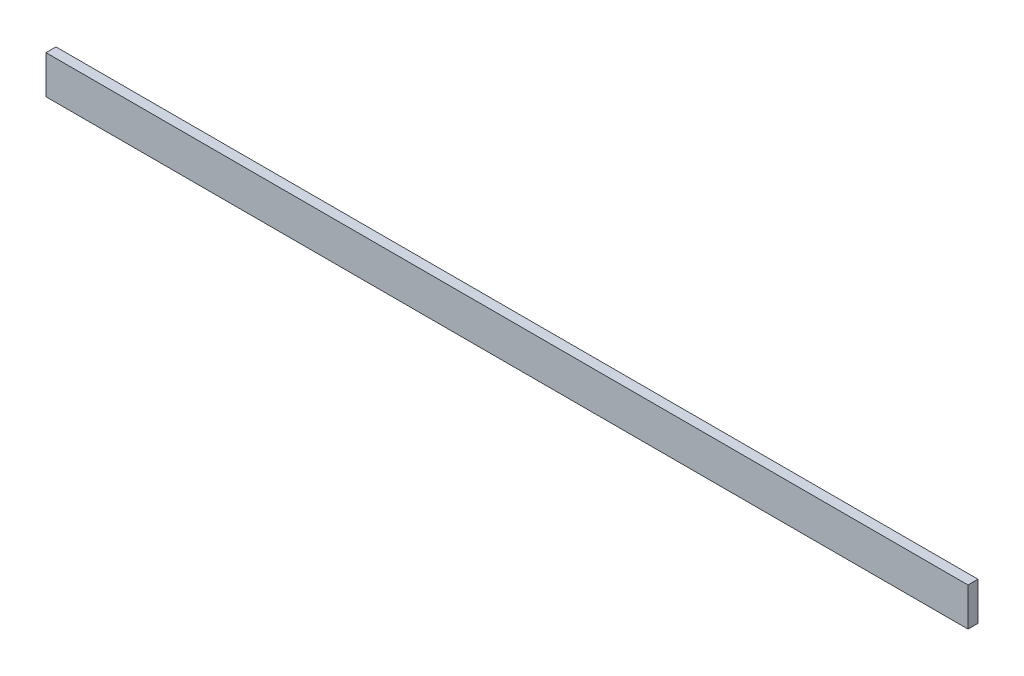
ISO-10303-21;
HEADER;
FILE_DESCRIPTION(('STEP AP214'),'2;1');
FILE_NAME('part.step','',(''),(''),'','','');
FILE_SCHEMA(('AUTOMOTIVE_DESIGN { 1 0 10303 214 1 1 1 1 }'));
ENDSEC;
DATA;
#1=APPLICATION_CONTEXT('core data for automotive mechanical design processes');
#2=APPLICATION_PROTOCOL_DEFINITION('international standard','automotive_design',2000,#1);
#3=PRODUCT_CONTEXT('',#1,'mechanical');
#4=PRODUCT('Part','Part','',(#3));
#5=PRODUCT_RELATED_PRODUCT_CATEGORY('part','',(#4));
#6=PRODUCT_DEFINITION_FORMATION('','',#4);
#7=PRODUCT_DEFINITION_CONTEXT('part definition',#1,'design');
#8=PRODUCT_DEFINITION('design','',#6,#7);
#9=PRODUCT_DEFINITION_SHAPE('','',#8);
#10=(LENGTH_UNIT() NAMED_UNIT(*) SI_UNIT(.MILLI.,.METRE.));
#11=(NAMED_UNIT(*) PLANE_ANGLE_UNIT() SI_UNIT($,.RADIAN.));
#12=(NAMED_UNIT(*) SI_UNIT($,.STERADIAN.) SOLID_ANGLE_UNIT());
#13=UNCERTAINTY_MEASURE_WITH_UNIT(LENGTH_MEASURE(1.E-05),#10,'distance_accuracy_value','');
#14=(GEOMETRIC_REPRESENTATION_CONTEXT(3) GLOBAL_UNCERTAINTY_ASSIGNED_CONTEXT((#13)) GLOBAL_UNIT_ASSIGNED_CONTEXT((#10,
#11,#12)) REPRESENTATION_CONTEXT('',''));
#15=CARTESIAN_POINT('',(0.,0.,0.));
#16=DIRECTION('',(0.,0.,1.));
#17=DIRECTION('',(1.,0.,0.));
#18=AXIS2_PLACEMENT_3D('',#15,#16,#17);
#19=CARTESIAN_POINT('',(0.,38.2926221353073,10.));
#20=DIRECTION('',(1.,0.,0.));
#21=DIRECTION('',(0.,0.,-1.));
#22=AXIS2_PLACEMENT_3D('',#19,#20,#21);
#23=PLANE('',#22);
#24=DIRECTION('',(0.,-1.,0.));
#25=VECTOR('',#24,1.);
#26=CARTESIAN_POINT('',(0.,38.2926221353073,0.));
#27=LINE('',#26,#25);
#28=CARTESIAN_POINT('',(0.,38.2926221353073,0.));
#29=VERTEX_POINT('',#28);
#30=CARTESIAN_POINT('',(0.,0.,0.));
#31=VERTEX_POINT('',#30);
#32=EDGE_CURVE('E113',#29,#31,#27,.T.);
#33=ORIENTED_EDGE('',*,*,#32,.T.);
#34=DIRECTION('',(0.,0.,-1.));
#35=VECTOR('',#34,1.);
#36=CARTESIAN_POINT('',(0.,0.,10.));
#37=LINE('',#36,#35);
#38=CARTESIAN_POINT('',(0.,0.,10.));
#39=VERTEX_POINT('',#38);
#40=EDGE_CURVE('E11',#39,#31,#37,.T.);
#41=ORIENTED_EDGE('',*,*,#40,.F.);
#42=DIRECTION('',(0.,-1.,0.));
#43=VECTOR('',#42,1.);
#44=CARTESIAN_POINT('',(0.,38.2926221353073,10.));
#45=LINE('',#44,#43);
#46=CARTESIAN_POINT('',(0.,38.2926221353073,10.));
#47=VERTEX_POINT('',#46);
#48=EDGE_CURVE('E97',#47,#39,#45,.T.);
#49=ORIENTED_EDGE('',*,*,#48,.F.);
#50=DIRECTION('',(0.,0.,-1.));
#51=VECTOR('',#50,1.);
#52=CARTESIAN_POINT('',(0.,38.2926221353073,10.));
#53=LINE('',#52,#51);
#54=EDGE_CURVE('E109',#47,#29,#53,.T.);
#55=ORIENTED_EDGE('',*,*,#54,.T.);
#56=EDGE_LOOP('',(#33,#41,#49,#55));
#57=FACE_BOUND('',#56,.T.);
#58=ADVANCED_FACE('F45',(#57),#23,.F.);
#59=CARTESIAN_POINT('',(0.,0.,10.));
#60=DIRECTION('',(0.,1.,0.));
#61=DIRECTION('',(0.,0.,1.));
#62=AXIS2_PLACEMENT_3D('',#59,#60,#61);
#63=PLANE('',#62);
#64=DIRECTION('',(1.,0.,0.));
#65=VECTOR('',#64,1.);
#66=CARTESIAN_POINT('',(0.,0.,0.));
#67=LINE('',#66,#65);
#68=CARTESIAN_POINT('',(923.185592949897,0.,0.));
#69=VERTEX_POINT('',#68);
#70=EDGE_CURVE('E102',#31,#69,#67,.T.);
#71=ORIENTED_EDGE('',*,*,#70,.T.);
#72=DIRECTION('',(0.,0.,-1.));
#73=VECTOR('',#72,1.);
#74=CARTESIAN_POINT('',(923.185592949897,0.,10.));
#75=LINE('',#74,#73);
#76=CARTESIAN_POINT('',(923.185592949897,0.,10.));
#77=VERTEX_POINT('',#76);
#78=EDGE_CURVE('E54',#77,#69,#75,.T.);
#79=ORIENTED_EDGE('',*,*,#78,.F.);
#80=DIRECTION('',(1.,0.,0.));
#81=VECTOR('',#80,1.);
#82=CARTESIAN_POINT('',(0.,0.,10.));
#83=LINE('',#82,#81);
#84=EDGE_CURVE('E92',#39,#77,#83,.T.);
#85=ORIENTED_EDGE('',*,*,#84,.F.);
#86=ORIENTED_EDGE('',*,*,#40,.T.);
#87=EDGE_LOOP('',(#71,#79,#85,#86));
#88=FACE_BOUND('',#87,.T.);
#89=ADVANCED_FACE('F101',(#88),#63,.F.);
#90=CARTESIAN_POINT('',(923.185592949897,0.,10.));
#91=DIRECTION('',(-1.,0.,0.));
#92=DIRECTION('',(0.,0.,1.));
#93=AXIS2_PLACEMENT_3D('',#90,#91,#92);
#94=PLANE('',#93);
#95=DIRECTION('',(0.,1.,0.));
#96=VECTOR('',#95,1.);
#97=CARTESIAN_POINT('',(923.185592949897,0.,0.));
#98=LINE('',#97,#96);
#99=CARTESIAN_POINT('',(923.185592949897,38.2926221353073,0.));
#100=VERTEX_POINT('',#99);
#101=EDGE_CURVE('E79',#69,#100,#98,.T.);
#102=ORIENTED_EDGE('',*,*,#101,.T.);
#103=DIRECTION('',(0.,0.,-1.));
#104=VECTOR('',#103,1.);
#105=CARTESIAN_POINT('',(923.185592949897,38.2926221353073,10.));
#106=LINE('',#105,#104);
#107=CARTESIAN_POINT('',(923.185592949897,38.2926221353073,10.));
#108=VERTEX_POINT('',#107);
#109=EDGE_CURVE('E104',#108,#100,#106,.T.);
#110=ORIENTED_EDGE('',*,*,#109,.F.);
#111=DIRECTION('',(0.,1.,0.));
#112=VECTOR('',#111,1.);
#113=CARTESIAN_POINT('',(923.185592949897,0.,10.));
#114=LINE('',#113,#112);
#115=EDGE_CURVE('E95',#77,#108,#114,.T.);
#116=ORIENTED_EDGE('',*,*,#115,.F.);
#117=ORIENTED_EDGE('',*,*,#78,.T.);
#118=EDGE_LOOP('',(#102,#110,#116,#117));
#119=FACE_BOUND('',#118,.T.);
#120=ADVANCED_FACE('F105',(#119),#94,.F.);
#121=CARTESIAN_POINT('',(923.185592949897,38.2926221353073,10.));
#122=DIRECTION('',(0.,-1.,0.));
#123=DIRECTION('',(0.,0.,-1.));
#124=AXIS2_PLACEMENT_3D('',#121,#122,#123);
#125=PLANE('',#124);
#126=DIRECTION('',(-1.,0.,0.));
#127=VECTOR('',#126,1.);
#128=CARTESIAN_POINT('',(923.185592949897,38.2926221353073,0.));
#129=LINE('',#128,#127);
#130=EDGE_CURVE('E85',#100,#29,#129,.T.);
#131=ORIENTED_EDGE('',*,*,#130,.T.);
#132=ORIENTED_EDGE('',*,*,#54,.F.);
#133=DIRECTION('',(-1.,0.,0.));
#134=VECTOR('',#133,1.);
#135=CARTESIAN_POINT('',(923.185592949897,38.2926221353073,10.));
#136=LINE('',#135,#134);
#137=EDGE_CURVE('E62',#108,#47,#136,.T.);
#138=ORIENTED_EDGE('',*,*,#137,.F.);
#139=ORIENTED_EDGE('',*,*,#109,.T.);
#140=EDGE_LOOP('',(#131,#132,#138,#139));
#141=FACE_BOUND('',#140,.T.);
#142=ADVANCED_FACE('F126',(#141),#125,.F.);
#143=CARTESIAN_POINT('',(0.,0.,10.));
#144=DIRECTION('',(0.,0.,1.));
#145=DIRECTION('',(1.,0.,0.));
#146=AXIS2_PLACEMENT_3D('',#143,#144,#145);
#147=PLANE('',#146);
#148=ORIENTED_EDGE('',*,*,#48,.T.);
#149=ORIENTED_EDGE('',*,*,#84,.T.);
#150=ORIENTED_EDGE('',*,*,#115,.T.);
#151=ORIENTED_EDGE('',*,*,#137,.T.);
#152=EDGE_LOOP('',(#148,#149,#150,#151));
#153=FACE_BOUND('',#152,.T.);
#154=ADVANCED_FACE('F93',(#153),#147,.T.);
#155=CARTESIAN_POINT('',(0.,0.,0.));
#156=DIRECTION('',(0.,0.,1.));
#157=DIRECTION('',(1.,0.,0.));
#158=AXIS2_PLACEMENT_3D('',#155,#156,#157);
#159=PLANE('',#158);
#160=ORIENTED_EDGE('',*,*,#32,.F.);
#161=ORIENTED_EDGE('',*,*,#130,.F.);
#162=ORIENTED_EDGE('',*,*,#101,.F.);
#163=ORIENTED_EDGE('',*,*,#70,.F.);
#164=EDGE_LOOP('',(#160,#161,#162,#163));
#165=FACE_BOUND('',#164,.T.);
#166=ADVANCED_FACE('F129',(#165),#159,.F.);
#167=CLOSED_SHELL('',(#58,#89,#120,#142,#154,#166));
#168=MANIFOLD_SOLID_BREP('B2',#167);
#169=ADVANCED_BREP_SHAPE_REPRESENTATION('',(#18,#168),#14);
#170=SHAPE_DEFINITION_REPRESENTATION(#9,#169);
ENDSEC;
END-ISO-10303-21;
